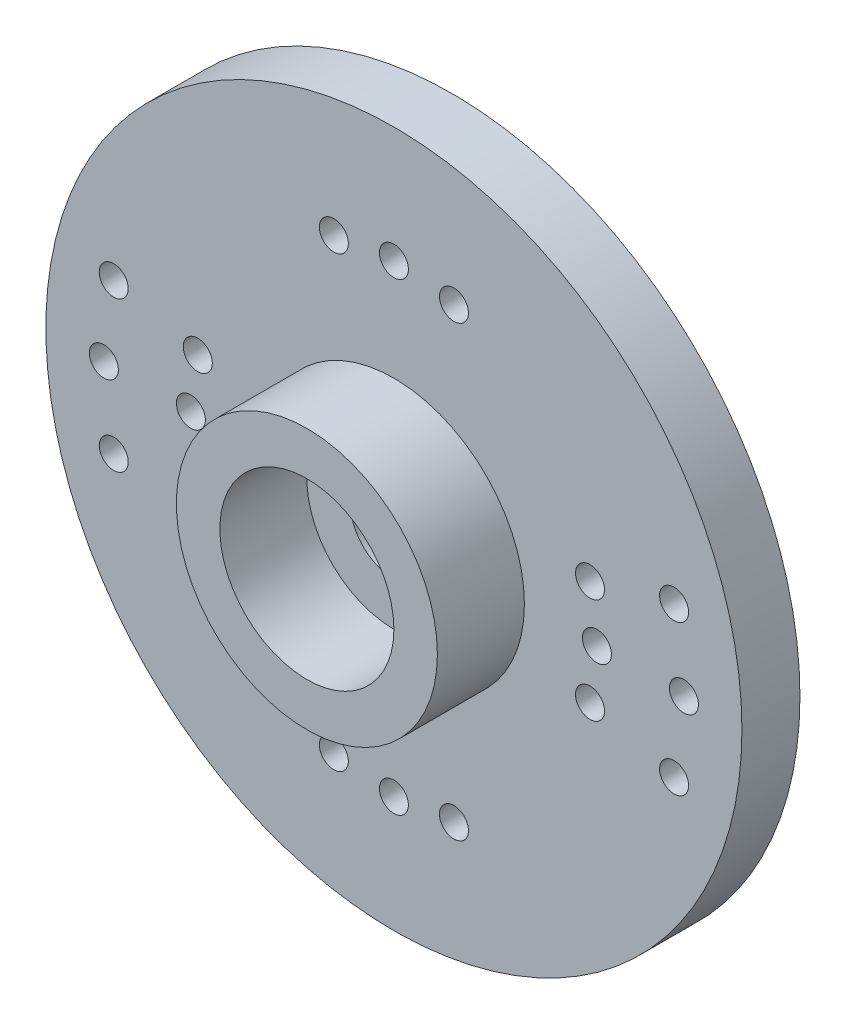
ISO-10303-21;
HEADER;
FILE_DESCRIPTION(('STEP AP214'),'2;1');
FILE_NAME('part.step','',(''),(''),'','','');
FILE_SCHEMA(('AUTOMOTIVE_DESIGN { 1 0 10303 214 1 1 1 1 }'));
ENDSEC;
DATA;
#1=APPLICATION_CONTEXT('core data for automotive mechanical design processes');
#2=APPLICATION_PROTOCOL_DEFINITION('international standard','automotive_design',2000,#1);
#3=PRODUCT_CONTEXT('',#1,'mechanical');
#4=PRODUCT('Part','Part','',(#3));
#5=PRODUCT_RELATED_PRODUCT_CATEGORY('part','',(#4));
#6=PRODUCT_DEFINITION_FORMATION('','',#4);
#7=PRODUCT_DEFINITION_CONTEXT('part definition',#1,'design');
#8=PRODUCT_DEFINITION('design','',#6,#7);
#9=PRODUCT_DEFINITION_SHAPE('','',#8);
#10=(LENGTH_UNIT() NAMED_UNIT(*) SI_UNIT(.MILLI.,.METRE.));
#11=(NAMED_UNIT(*) PLANE_ANGLE_UNIT() SI_UNIT($,.RADIAN.));
#12=(NAMED_UNIT(*) SI_UNIT($,.STERADIAN.) SOLID_ANGLE_UNIT());
#13=UNCERTAINTY_MEASURE_WITH_UNIT(LENGTH_MEASURE(1.E-05),#10,'distance_accuracy_value','');
#14=(GEOMETRIC_REPRESENTATION_CONTEXT(3) GLOBAL_UNCERTAINTY_ASSIGNED_CONTEXT((#13)) GLOBAL_UNIT_ASSIGNED_CONTEXT((#10,
#11,#12)) REPRESENTATION_CONTEXT('',''));
#15=CARTESIAN_POINT('',(0.,0.,0.));
#16=DIRECTION('',(0.,0.,1.));
#17=DIRECTION('',(1.,0.,0.));
#18=AXIS2_PLACEMENT_3D('',#15,#16,#17);
#19=CARTESIAN_POINT('',(-46.6929418583913,3.175,0.));
#20=DIRECTION('',(0.,0.,1.));
#21=DIRECTION('',(1.,0.,0.));
#22=AXIS2_PLACEMENT_3D('',#19,#20,#21);
#23=PLANE('',#22);
#24=CARTESIAN_POINT('',(-46.6929418583913,3.175,0.));
#25=DIRECTION('',(0.,0.,1.));
#26=DIRECTION('',(1.,0.,0.));
#27=AXIS2_PLACEMENT_3D('',#24,#25,#26);
#28=CIRCLE('',#27,1.5);
#29=CARTESIAN_POINT('',(-45.1929418583913,3.175,0.));
#30=VERTEX_POINT('',#29);
#31=EDGE_CURVE('E59',#30,#30,#28,.T.);
#32=ORIENTED_EDGE('',*,*,#31,.T.);
#33=EDGE_LOOP('',(#32));
#34=FACE_BOUND('',#33,.T.);
#35=CARTESIAN_POINT('',(-46.6929418583913,3.175,0.));
#36=DIRECTION('',(0.,0.,-1.));
#37=DIRECTION('',(-1.,0.,0.));
#38=AXIS2_PLACEMENT_3D('',#35,#36,#37);
#39=CIRCLE('',#38,3.);
#40=CARTESIAN_POINT('',(-49.6929418583913,3.175,0.));
#41=VERTEX_POINT('',#40);
#42=EDGE_CURVE('E69',#41,#41,#39,.T.);
#43=ORIENTED_EDGE('',*,*,#42,.T.);
#44=EDGE_LOOP('',(#43));
#45=FACE_BOUND('',#44,.T.);
#46=ADVANCED_FACE('F30',(#34,#45),#23,.F.);
#47=CARTESIAN_POINT('',(-46.6929418583913,3.175,2.));
#48=DIRECTION('',(0.,0.,-1.));
#49=DIRECTION('',(-1.,0.,0.));
#50=AXIS2_PLACEMENT_3D('',#47,#48,#49);
#51=CYLINDRICAL_SURFACE('',#50,12.);
#52=CARTESIAN_POINT('',(-46.6929418583913,3.175,2.));
#53=DIRECTION('',(0.,0.,1.));
#54=DIRECTION('',(1.,0.,0.));
#55=AXIS2_PLACEMENT_3D('',#52,#53,#54);
#56=CIRCLE('',#55,12.);
#57=CARTESIAN_POINT('',(-34.6929418583913,3.175,2.));
#58=VERTEX_POINT('',#57);
#59=EDGE_CURVE('E41',#58,#58,#56,.T.);
#60=ORIENTED_EDGE('',*,*,#59,.F.);
#61=EDGE_LOOP('',(#60));
#62=FACE_BOUND('',#61,.T.);
#63=CARTESIAN_POINT('',(-46.6929418583913,3.175,0.));
#64=DIRECTION('',(0.,0.,1.));
#65=DIRECTION('',(1.,0.,0.));
#66=AXIS2_PLACEMENT_3D('',#63,#64,#65);
#67=CIRCLE('',#66,12.);
#68=CARTESIAN_POINT('',(-34.6929418583913,3.175,0.));
#69=VERTEX_POINT('',#68);
#70=EDGE_CURVE('E45',#69,#69,#67,.T.);
#71=ORIENTED_EDGE('',*,*,#70,.T.);
#72=EDGE_LOOP('',(#71));
#73=FACE_BOUND('',#72,.T.);
#74=ADVANCED_FACE('F32',(#62,#73),#51,.T.);
#75=CARTESIAN_POINT('',(-46.6929418583913,3.175,2.));
#76=DIRECTION('',(0.,0.,1.));
#77=DIRECTION('',(1.,0.,0.));
#78=AXIS2_PLACEMENT_3D('',#75,#76,#77);
#79=PLANE('',#78);
#80=CARTESIAN_POINT('',(-56.352200121282,5.76319045102514,2.));
#81=DIRECTION('',(0.,0.,-1.));
#82=DIRECTION('',(-1.,0.,0.));
#83=AXIS2_PLACEMENT_3D('',#80,#81,#82);
#84=CIRCLE('',#83,0.499999999999997);
#85=CARTESIAN_POINT('',(-56.852200121282,5.76319045102514,2.));
#86=VERTEX_POINT('',#85);
#87=EDGE_CURVE('E177',#86,#86,#84,.T.);
#88=ORIENTED_EDGE('',*,*,#87,.T.);
#89=EDGE_LOOP('',(#88));
#90=FACE_BOUND('',#89,.T.);
#91=CARTESIAN_POINT('',(-56.6929418583913,3.17499999999993,2.));
#92=DIRECTION('',(0.,0.,-1.));
#93=DIRECTION('',(-1.,0.,0.));
#94=AXIS2_PLACEMENT_3D('',#91,#92,#93);
#95=CIRCLE('',#94,0.499999999999998);
#96=CARTESIAN_POINT('',(-57.1929418583913,3.17499999999993,2.));
#97=VERTEX_POINT('',#96);
#98=EDGE_CURVE('E171',#97,#97,#95,.T.);
#99=ORIENTED_EDGE('',*,*,#98,.T.);
#100=EDGE_LOOP('',(#99));
#101=FACE_BOUND('',#100,.T.);
#102=CARTESIAN_POINT('',(-56.352200121282,0.586809548974715,2.));
#103=DIRECTION('',(0.,0.,-1.));
#104=DIRECTION('',(-1.,0.,0.));
#105=AXIS2_PLACEMENT_3D('',#102,#103,#104);
#106=CIRCLE('',#105,0.5);
#107=CARTESIAN_POINT('',(-56.852200121282,0.586809548974715,2.));
#108=VERTEX_POINT('',#107);
#109=EDGE_CURVE('E165',#108,#108,#106,.T.);
#110=ORIENTED_EDGE('',*,*,#109,.T.);
#111=EDGE_LOOP('',(#110));
#112=FACE_BOUND('',#111,.T.);
#113=CARTESIAN_POINT('',(-53.4544226424148,1.3632666842823,2.));
#114=DIRECTION('',(0.,0.,-1.));
#115=DIRECTION('',(-1.,0.,0.));
#116=AXIS2_PLACEMENT_3D('',#113,#114,#115);
#117=CIRCLE('',#116,0.499999999999999);
#118=CARTESIAN_POINT('',(-53.9544226424148,1.3632666842823,2.));
#119=VERTEX_POINT('',#118);
#120=EDGE_CURVE('E159',#119,#119,#117,.T.);
#121=ORIENTED_EDGE('',*,*,#120,.T.);
#122=EDGE_LOOP('',(#121));
#123=FACE_BOUND('',#122,.T.);
#124=CARTESIAN_POINT('',(-53.6929418583913,3.17499999999995,2.));
#125=DIRECTION('',(0.,0.,-1.));
#126=DIRECTION('',(-1.,0.,0.));
#127=AXIS2_PLACEMENT_3D('',#124,#125,#126);
#128=CIRCLE('',#127,0.499999999999998);
#129=CARTESIAN_POINT('',(-54.1929418583913,3.17499999999995,2.));
#130=VERTEX_POINT('',#129);
#131=EDGE_CURVE('E153',#130,#130,#128,.T.);
#132=ORIENTED_EDGE('',*,*,#131,.T.);
#133=EDGE_LOOP('',(#132));
#134=FACE_BOUND('',#133,.T.);
#135=CARTESIAN_POINT('',(-53.4544226424148,4.9867333157176,2.));
#136=DIRECTION('',(0.,0.,-1.));
#137=DIRECTION('',(-1.,0.,0.));
#138=AXIS2_PLACEMENT_3D('',#135,#136,#137);
#139=CIRCLE('',#138,0.500000000000003);
#140=CARTESIAN_POINT('',(-53.9544226424148,4.9867333157176,2.));
#141=VERTEX_POINT('',#140);
#142=EDGE_CURVE('E147',#141,#141,#139,.T.);
#143=ORIENTED_EDGE('',*,*,#142,.T.);
#144=EDGE_LOOP('',(#143));
#145=FACE_BOUND('',#144,.T.);
#146=CARTESIAN_POINT('',(-48.7634942192115,10.9024066103125,2.));
#147=DIRECTION('',(0.,0.,-1.));
#148=DIRECTION('',(-1.,0.,0.));
#149=AXIS2_PLACEMENT_3D('',#146,#147,#148);
#150=CIRCLE('',#149,0.499999999999992);
#151=CARTESIAN_POINT('',(-49.2634942192115,10.9024066103125,2.));
#152=VERTEX_POINT('',#151);
#153=EDGE_CURVE('E141',#152,#152,#150,.T.);
#154=ORIENTED_EDGE('',*,*,#153,.T.);
#155=EDGE_LOOP('',(#154));
#156=FACE_BOUND('',#155,.T.);
#157=CARTESIAN_POINT('',(-46.6929418583913,11.175,2.));
#158=DIRECTION('',(0.,0.,-1.));
#159=DIRECTION('',(-1.,0.,0.));
#160=AXIS2_PLACEMENT_3D('',#157,#158,#159);
#161=CIRCLE('',#160,0.499999999999999);
#162=CARTESIAN_POINT('',(-47.1929418583913,11.175,2.));
#163=VERTEX_POINT('',#162);
#164=EDGE_CURVE('E135',#163,#163,#161,.T.);
#165=ORIENTED_EDGE('',*,*,#164,.T.);
#166=EDGE_LOOP('',(#165));
#167=FACE_BOUND('',#166,.T.);
#168=CARTESIAN_POINT('',(-44.6223894975711,10.9024066103125,2.));
#169=DIRECTION('',(0.,0.,-1.));
#170=DIRECTION('',(-1.,0.,0.));
#171=AXIS2_PLACEMENT_3D('',#168,#169,#170);
#172=CIRCLE('',#171,0.499999999999999);
#173=CARTESIAN_POINT('',(-45.1223894975711,10.9024066103125,2.));
#174=VERTEX_POINT('',#173);
#175=EDGE_CURVE('E129',#174,#174,#172,.T.);
#176=ORIENTED_EDGE('',*,*,#175,.T.);
#177=EDGE_LOOP('',(#176));
#178=FACE_BOUND('',#177,.T.);
#179=CARTESIAN_POINT('',(-39.9314610743678,4.98673331571765,2.));
#180=DIRECTION('',(0.,0.,-1.));
#181=DIRECTION('',(-1.,0.,0.));
#182=AXIS2_PLACEMENT_3D('',#179,#180,#181);
#183=CIRCLE('',#182,0.5);
#184=CARTESIAN_POINT('',(-40.4314610743678,4.98673331571765,2.));
#185=VERTEX_POINT('',#184);
#186=EDGE_CURVE('E123',#185,#185,#183,.T.);
#187=ORIENTED_EDGE('',*,*,#186,.T.);
#188=EDGE_LOOP('',(#187));
#189=FACE_BOUND('',#188,.T.);
#190=CARTESIAN_POINT('',(-37.0336835955006,5.76319045102521,2.));
#191=DIRECTION('',(0.,0.,-1.));
#192=DIRECTION('',(-1.,0.,0.));
#193=AXIS2_PLACEMENT_3D('',#190,#191,#192);
#194=CIRCLE('',#193,0.5);
#195=CARTESIAN_POINT('',(-37.5336835955006,5.76319045102521,2.));
#196=VERTEX_POINT('',#195);
#197=EDGE_CURVE('E117',#196,#196,#194,.T.);
#198=ORIENTED_EDGE('',*,*,#197,.T.);
#199=EDGE_LOOP('',(#198));
#200=FACE_BOUND('',#199,.T.);
#201=CARTESIAN_POINT('',(-39.6929418583913,3.175,2.));
#202=DIRECTION('',(0.,0.,-1.));
#203=DIRECTION('',(-1.,0.,0.));
#204=AXIS2_PLACEMENT_3D('',#201,#202,#203);
#205=CIRCLE('',#204,0.499999999999999);
#206=CARTESIAN_POINT('',(-40.1929418583913,3.175,2.));
#207=VERTEX_POINT('',#206);
#208=EDGE_CURVE('E111',#207,#207,#205,.T.);
#209=ORIENTED_EDGE('',*,*,#208,.T.);
#210=EDGE_LOOP('',(#209));
#211=FACE_BOUND('',#210,.T.);
#212=CARTESIAN_POINT('',(-36.6929418583913,3.175,2.));
#213=DIRECTION('',(0.,0.,-1.));
#214=DIRECTION('',(-1.,0.,0.));
#215=AXIS2_PLACEMENT_3D('',#212,#213,#214);
#216=CIRCLE('',#215,0.499999999999999);
#217=CARTESIAN_POINT('',(-37.1929418583913,3.175,2.));
#218=VERTEX_POINT('',#217);
#219=EDGE_CURVE('E105',#218,#218,#216,.T.);
#220=ORIENTED_EDGE('',*,*,#219,.T.);
#221=EDGE_LOOP('',(#220));
#222=FACE_BOUND('',#221,.T.);
#223=CARTESIAN_POINT('',(-37.0336835955006,0.586809548974783,2.));
#224=DIRECTION('',(0.,0.,-1.));
#225=DIRECTION('',(-1.,0.,0.));
#226=AXIS2_PLACEMENT_3D('',#223,#224,#225);
#227=CIRCLE('',#226,0.499999999999997);
#228=CARTESIAN_POINT('',(-37.5336835955006,0.586809548974783,2.));
#229=VERTEX_POINT('',#228);
#230=EDGE_CURVE('E99',#229,#229,#227,.T.);
#231=ORIENTED_EDGE('',*,*,#230,.T.);
#232=EDGE_LOOP('',(#231));
#233=FACE_BOUND('',#232,.T.);
#234=CARTESIAN_POINT('',(-39.9314610743678,1.36326668428235,2.));
#235=DIRECTION('',(0.,0.,-1.));
#236=DIRECTION('',(-1.,0.,0.));
#237=AXIS2_PLACEMENT_3D('',#234,#235,#236);
#238=CIRCLE('',#237,0.499999999999998);
#239=CARTESIAN_POINT('',(-40.4314610743678,1.36326668428235,2.));
#240=VERTEX_POINT('',#239);
#241=EDGE_CURVE('E93',#240,#240,#238,.T.);
#242=ORIENTED_EDGE('',*,*,#241,.T.);
#243=EDGE_LOOP('',(#242));
#244=FACE_BOUND('',#243,.T.);
#245=CARTESIAN_POINT('',(-46.6929418583913,-4.825,2.));
#246=DIRECTION('',(0.,0.,-1.));
#247=DIRECTION('',(-1.,0.,0.));
#248=AXIS2_PLACEMENT_3D('',#245,#246,#247);
#249=CIRCLE('',#248,0.499999999999999);
#250=CARTESIAN_POINT('',(-47.1929418583913,-4.825,2.));
#251=VERTEX_POINT('',#250);
#252=EDGE_CURVE('E87',#251,#251,#249,.T.);
#253=ORIENTED_EDGE('',*,*,#252,.T.);
#254=EDGE_LOOP('',(#253));
#255=FACE_BOUND('',#254,.T.);
#256=CARTESIAN_POINT('',(-44.6223894975711,-4.55240661031254,2.));
#257=DIRECTION('',(0.,0.,-1.));
#258=DIRECTION('',(-1.,0.,0.));
#259=AXIS2_PLACEMENT_3D('',#256,#257,#258);
#260=CIRCLE('',#259,0.499999999999999);
#261=CARTESIAN_POINT('',(-45.1223894975711,-4.55240661031254,2.));
#262=VERTEX_POINT('',#261);
#263=EDGE_CURVE('E81',#262,#262,#260,.T.);
#264=ORIENTED_EDGE('',*,*,#263,.T.);
#265=EDGE_LOOP('',(#264));
#266=FACE_BOUND('',#265,.T.);
#267=CARTESIAN_POINT('',(-48.7634942192115,-4.55240661031255,2.));
#268=DIRECTION('',(0.,0.,-1.));
#269=DIRECTION('',(-1.,0.,0.));
#270=AXIS2_PLACEMENT_3D('',#267,#268,#269);
#271=CIRCLE('',#270,0.499999999999999);
#272=CARTESIAN_POINT('',(-49.2634942192115,-4.55240661031255,2.));
#273=VERTEX_POINT('',#272);
#274=EDGE_CURVE('E72',#273,#273,#271,.T.);
#275=ORIENTED_EDGE('',*,*,#274,.T.);
#276=EDGE_LOOP('',(#275));
#277=FACE_BOUND('',#276,.T.);
#278=CARTESIAN_POINT('',(-46.6929418583913,3.175,2.));
#279=DIRECTION('',(0.,0.,1.));
#280=DIRECTION('',(1.,0.,0.));
#281=AXIS2_PLACEMENT_3D('',#278,#279,#280);
#282=CIRCLE('',#281,4.5);
#283=CARTESIAN_POINT('',(-42.1929418583913,3.175,2.));
#284=VERTEX_POINT('',#283);
#285=EDGE_CURVE('E51',#284,#284,#282,.T.);
#286=ORIENTED_EDGE('',*,*,#285,.F.);
#287=EDGE_LOOP('',(#286));
#288=FACE_BOUND('',#287,.T.);
#289=ORIENTED_EDGE('',*,*,#59,.T.);
#290=EDGE_LOOP('',(#289));
#291=FACE_BOUND('',#290,.T.);
#292=ADVANCED_FACE('F189',(#90,#101,#112,#123,#134,#145,#156,#167,#178,#189,#200,#211,#222,#233,
#244,#255,#266,#277,#288,#291),#79,.T.);
#293=CARTESIAN_POINT('',(-56.352200121282,5.76319045102514,0.));
#294=DIRECTION('',(0.,0.,-1.));
#295=DIRECTION('',(-1.,0.,0.));
#296=AXIS2_PLACEMENT_3D('',#293,#294,#295);
#297=CIRCLE('',#296,0.499999999999997);
#298=CARTESIAN_POINT('',(-56.852200121282,5.76319045102514,0.));
#299=VERTEX_POINT('',#298);
#300=EDGE_CURVE('E174',#299,#299,#297,.T.);
#301=ORIENTED_EDGE('',*,*,#300,.F.);
#302=EDGE_LOOP('',(#301));
#303=FACE_BOUND('',#302,.T.);
#304=CARTESIAN_POINT('',(-56.6929418583913,3.17499999999993,0.));
#305=DIRECTION('',(0.,0.,-1.));
#306=DIRECTION('',(-1.,0.,0.));
#307=AXIS2_PLACEMENT_3D('',#304,#305,#306);
#308=CIRCLE('',#307,0.499999999999998);
#309=CARTESIAN_POINT('',(-57.1929418583913,3.17499999999993,0.));
#310=VERTEX_POINT('',#309);
#311=EDGE_CURVE('E168',#310,#310,#308,.T.);
#312=ORIENTED_EDGE('',*,*,#311,.F.);
#313=EDGE_LOOP('',(#312));
#314=FACE_BOUND('',#313,.T.);
#315=CARTESIAN_POINT('',(-56.352200121282,0.586809548974715,0.));
#316=DIRECTION('',(0.,0.,-1.));
#317=DIRECTION('',(-1.,0.,0.));
#318=AXIS2_PLACEMENT_3D('',#315,#316,#317);
#319=CIRCLE('',#318,0.5);
#320=CARTESIAN_POINT('',(-56.852200121282,0.586809548974715,0.));
#321=VERTEX_POINT('',#320);
#322=EDGE_CURVE('E162',#321,#321,#319,.T.);
#323=ORIENTED_EDGE('',*,*,#322,.F.);
#324=EDGE_LOOP('',(#323));
#325=FACE_BOUND('',#324,.T.);
#326=CARTESIAN_POINT('',(-53.4544226424148,1.3632666842823,0.));
#327=DIRECTION('',(0.,0.,-1.));
#328=DIRECTION('',(-1.,0.,0.));
#329=AXIS2_PLACEMENT_3D('',#326,#327,#328);
#330=CIRCLE('',#329,0.499999999999999);
#331=CARTESIAN_POINT('',(-53.9544226424148,1.3632666842823,0.));
#332=VERTEX_POINT('',#331);
#333=EDGE_CURVE('E156',#332,#332,#330,.T.);
#334=ORIENTED_EDGE('',*,*,#333,.F.);
#335=EDGE_LOOP('',(#334));
#336=FACE_BOUND('',#335,.T.);
#337=CARTESIAN_POINT('',(-53.6929418583913,3.17499999999995,0.));
#338=DIRECTION('',(0.,0.,-1.));
#339=DIRECTION('',(-1.,0.,0.));
#340=AXIS2_PLACEMENT_3D('',#337,#338,#339);
#341=CIRCLE('',#340,0.499999999999998);
#342=CARTESIAN_POINT('',(-54.1929418583913,3.17499999999995,0.));
#343=VERTEX_POINT('',#342);
#344=EDGE_CURVE('E150',#343,#343,#341,.T.);
#345=ORIENTED_EDGE('',*,*,#344,.F.);
#346=EDGE_LOOP('',(#345));
#347=FACE_BOUND('',#346,.T.);
#348=CARTESIAN_POINT('',(-53.4544226424148,4.9867333157176,0.));
#349=DIRECTION('',(0.,0.,-1.));
#350=DIRECTION('',(-1.,0.,0.));
#351=AXIS2_PLACEMENT_3D('',#348,#349,#350);
#352=CIRCLE('',#351,0.500000000000003);
#353=CARTESIAN_POINT('',(-53.9544226424148,4.9867333157176,0.));
#354=VERTEX_POINT('',#353);
#355=EDGE_CURVE('E144',#354,#354,#352,.T.);
#356=ORIENTED_EDGE('',*,*,#355,.F.);
#357=EDGE_LOOP('',(#356));
#358=FACE_BOUND('',#357,.T.);
#359=CARTESIAN_POINT('',(-48.7634942192115,10.9024066103125,0.));
#360=DIRECTION('',(0.,0.,-1.));
#361=DIRECTION('',(-1.,0.,0.));
#362=AXIS2_PLACEMENT_3D('',#359,#360,#361);
#363=CIRCLE('',#362,0.499999999999992);
#364=CARTESIAN_POINT('',(-49.2634942192115,10.9024066103125,0.));
#365=VERTEX_POINT('',#364);
#366=EDGE_CURVE('E138',#365,#365,#363,.T.);
#367=ORIENTED_EDGE('',*,*,#366,.F.);
#368=EDGE_LOOP('',(#367));
#369=FACE_BOUND('',#368,.T.);
#370=CARTESIAN_POINT('',(-46.6929418583913,11.175,0.));
#371=DIRECTION('',(0.,0.,-1.));
#372=DIRECTION('',(-1.,0.,0.));
#373=AXIS2_PLACEMENT_3D('',#370,#371,#372);
#374=CIRCLE('',#373,0.499999999999999);
#375=CARTESIAN_POINT('',(-47.1929418583913,11.175,0.));
#376=VERTEX_POINT('',#375);
#377=EDGE_CURVE('E132',#376,#376,#374,.T.);
#378=ORIENTED_EDGE('',*,*,#377,.F.);
#379=EDGE_LOOP('',(#378));
#380=FACE_BOUND('',#379,.T.);
#381=CARTESIAN_POINT('',(-44.6223894975711,10.9024066103125,0.));
#382=DIRECTION('',(0.,0.,-1.));
#383=DIRECTION('',(-1.,0.,0.));
#384=AXIS2_PLACEMENT_3D('',#381,#382,#383);
#385=CIRCLE('',#384,0.499999999999999);
#386=CARTESIAN_POINT('',(-45.1223894975711,10.9024066103125,0.));
#387=VERTEX_POINT('',#386);
#388=EDGE_CURVE('E126',#387,#387,#385,.T.);
#389=ORIENTED_EDGE('',*,*,#388,.F.);
#390=EDGE_LOOP('',(#389));
#391=FACE_BOUND('',#390,.T.);
#392=CARTESIAN_POINT('',(-39.9314610743678,4.98673331571765,0.));
#393=DIRECTION('',(0.,0.,-1.));
#394=DIRECTION('',(-1.,0.,0.));
#395=AXIS2_PLACEMENT_3D('',#392,#393,#394);
#396=CIRCLE('',#395,0.5);
#397=CARTESIAN_POINT('',(-40.4314610743678,4.98673331571765,0.));
#398=VERTEX_POINT('',#397);
#399=EDGE_CURVE('E120',#398,#398,#396,.T.);
#400=ORIENTED_EDGE('',*,*,#399,.F.);
#401=EDGE_LOOP('',(#400));
#402=FACE_BOUND('',#401,.T.);
#403=CARTESIAN_POINT('',(-37.0336835955006,5.76319045102521,0.));
#404=DIRECTION('',(0.,0.,-1.));
#405=DIRECTION('',(-1.,0.,0.));
#406=AXIS2_PLACEMENT_3D('',#403,#404,#405);
#407=CIRCLE('',#406,0.5);
#408=CARTESIAN_POINT('',(-37.5336835955006,5.76319045102521,0.));
#409=VERTEX_POINT('',#408);
#410=EDGE_CURVE('E114',#409,#409,#407,.T.);
#411=ORIENTED_EDGE('',*,*,#410,.F.);
#412=EDGE_LOOP('',(#411));
#413=FACE_BOUND('',#412,.T.);
#414=CARTESIAN_POINT('',(-39.6929418583913,3.175,0.));
#415=DIRECTION('',(0.,0.,-1.));
#416=DIRECTION('',(-1.,0.,0.));
#417=AXIS2_PLACEMENT_3D('',#414,#415,#416);
#418=CIRCLE('',#417,0.499999999999999);
#419=CARTESIAN_POINT('',(-40.1929418583913,3.175,0.));
#420=VERTEX_POINT('',#419);
#421=EDGE_CURVE('E108',#420,#420,#418,.T.);
#422=ORIENTED_EDGE('',*,*,#421,.F.);
#423=EDGE_LOOP('',(#422));
#424=FACE_BOUND('',#423,.T.);
#425=CARTESIAN_POINT('',(-36.6929418583913,3.175,0.));
#426=DIRECTION('',(0.,0.,-1.));
#427=DIRECTION('',(-1.,0.,0.));
#428=AXIS2_PLACEMENT_3D('',#425,#426,#427);
#429=CIRCLE('',#428,0.499999999999999);
#430=CARTESIAN_POINT('',(-37.1929418583913,3.175,0.));
#431=VERTEX_POINT('',#430);
#432=EDGE_CURVE('E102',#431,#431,#429,.T.);
#433=ORIENTED_EDGE('',*,*,#432,.F.);
#434=EDGE_LOOP('',(#433));
#435=FACE_BOUND('',#434,.T.);
#436=CARTESIAN_POINT('',(-37.0336835955006,0.586809548974783,0.));
#437=DIRECTION('',(0.,0.,-1.));
#438=DIRECTION('',(-1.,0.,0.));
#439=AXIS2_PLACEMENT_3D('',#436,#437,#438);
#440=CIRCLE('',#439,0.499999999999997);
#441=CARTESIAN_POINT('',(-37.5336835955006,0.586809548974783,0.));
#442=VERTEX_POINT('',#441);
#443=EDGE_CURVE('E96',#442,#442,#440,.T.);
#444=ORIENTED_EDGE('',*,*,#443,.F.);
#445=EDGE_LOOP('',(#444));
#446=FACE_BOUND('',#445,.T.);
#447=CARTESIAN_POINT('',(-39.9314610743678,1.36326668428235,0.));
#448=DIRECTION('',(0.,0.,-1.));
#449=DIRECTION('',(-1.,0.,0.));
#450=AXIS2_PLACEMENT_3D('',#447,#448,#449);
#451=CIRCLE('',#450,0.499999999999998);
#452=CARTESIAN_POINT('',(-40.4314610743678,1.36326668428235,0.));
#453=VERTEX_POINT('',#452);
#454=EDGE_CURVE('E90',#453,#453,#451,.T.);
#455=ORIENTED_EDGE('',*,*,#454,.F.);
#456=EDGE_LOOP('',(#455));
#457=FACE_BOUND('',#456,.T.);
#458=CARTESIAN_POINT('',(-46.6929418583913,-4.825,0.));
#459=DIRECTION('',(0.,0.,-1.));
#460=DIRECTION('',(-1.,0.,0.));
#461=AXIS2_PLACEMENT_3D('',#458,#459,#460);
#462=CIRCLE('',#461,0.499999999999999);
#463=CARTESIAN_POINT('',(-47.1929418583913,-4.825,0.));
#464=VERTEX_POINT('',#463);
#465=EDGE_CURVE('E84',#464,#464,#462,.T.);
#466=ORIENTED_EDGE('',*,*,#465,.F.);
#467=EDGE_LOOP('',(#466));
#468=FACE_BOUND('',#467,.T.);
#469=CARTESIAN_POINT('',(-44.6223894975711,-4.55240661031254,0.));
#470=DIRECTION('',(0.,0.,-1.));
#471=DIRECTION('',(-1.,0.,0.));
#472=AXIS2_PLACEMENT_3D('',#469,#470,#471);
#473=CIRCLE('',#472,0.499999999999999);
#474=CARTESIAN_POINT('',(-45.1223894975711,-4.55240661031254,0.));
#475=VERTEX_POINT('',#474);
#476=EDGE_CURVE('E78',#475,#475,#473,.T.);
#477=ORIENTED_EDGE('',*,*,#476,.F.);
#478=EDGE_LOOP('',(#477));
#479=FACE_BOUND('',#478,.T.);
#480=CARTESIAN_POINT('',(-48.7634942192115,-4.55240661031255,0.));
#481=DIRECTION('',(0.,0.,-1.));
#482=DIRECTION('',(-1.,0.,0.));
#483=AXIS2_PLACEMENT_3D('',#480,#481,#482);
#484=CIRCLE('',#483,0.499999999999999);
#485=CARTESIAN_POINT('',(-49.2634942192115,-4.55240661031255,0.));
#486=VERTEX_POINT('',#485);
#487=EDGE_CURVE('E75',#486,#486,#484,.T.);
#488=ORIENTED_EDGE('',*,*,#487,.F.);
#489=EDGE_LOOP('',(#488));
#490=FACE_BOUND('',#489,.T.);
#491=CARTESIAN_POINT('',(-46.6929418583913,3.175,0.));
#492=DIRECTION('',(0.,0.,1.));
#493=DIRECTION('',(1.,0.,0.));
#494=AXIS2_PLACEMENT_3D('',#491,#492,#493);
#495=CIRCLE('',#494,4.);
#496=CARTESIAN_POINT('',(-42.6929418583913,3.175,0.));
#497=VERTEX_POINT('',#496);
#498=EDGE_CURVE('E10',#497,#497,#495,.F.);
#499=ORIENTED_EDGE('',*,*,#498,.F.);
#500=EDGE_LOOP('',(#499));
#501=FACE_BOUND('',#500,.T.);
#502=ORIENTED_EDGE('',*,*,#70,.F.);
#503=EDGE_LOOP('',(#502));
#504=FACE_BOUND('',#503,.T.);
#505=ADVANCED_FACE('F185',(#303,#314,#325,#336,#347,#358,#369,#380,#391,#402,#413,#424,#435,
#446,#457,#468,#479,#490,#501,#504),#23,.F.);
#506=CARTESIAN_POINT('',(-46.6929418583913,3.175,5.));
#507=DIRECTION('',(0.,0.,1.));
#508=DIRECTION('',(1.,0.,0.));
#509=AXIS2_PLACEMENT_3D('',#506,#507,#508);
#510=PLANE('',#509);
#511=CARTESIAN_POINT('',(-46.6929418583913,3.175,5.));
#512=DIRECTION('',(0.,0.,1.));
#513=DIRECTION('',(1.,0.,0.));
#514=AXIS2_PLACEMENT_3D('',#511,#512,#513);
#515=CIRCLE('',#514,4.5);
#516=CARTESIAN_POINT('',(-42.1929418583913,3.175,5.));
#517=VERTEX_POINT('',#516);
#518=EDGE_CURVE('E49',#517,#517,#515,.T.);
#519=ORIENTED_EDGE('',*,*,#518,.T.);
#520=EDGE_LOOP('',(#519));
#521=FACE_BOUND('',#520,.T.);
#522=CARTESIAN_POINT('',(-46.6929418583913,3.175,5.));
#523=DIRECTION('',(0.,0.,1.));
#524=DIRECTION('',(1.,0.,0.));
#525=AXIS2_PLACEMENT_3D('',#522,#523,#524);
#526=CIRCLE('',#525,3.);
#527=CARTESIAN_POINT('',(-43.6929418583913,3.175,5.));
#528=VERTEX_POINT('',#527);
#529=EDGE_CURVE('E54',#528,#528,#526,.T.);
#530=ORIENTED_EDGE('',*,*,#529,.F.);
#531=EDGE_LOOP('',(#530));
#532=FACE_BOUND('',#531,.T.);
#533=ADVANCED_FACE('F188',(#521,#532),#510,.T.);
#534=CARTESIAN_POINT('',(-46.6929418583913,3.175,5.));
#535=DIRECTION('',(0.,0.,-1.));
#536=DIRECTION('',(-1.,0.,0.));
#537=AXIS2_PLACEMENT_3D('',#534,#535,#536);
#538=CYLINDRICAL_SURFACE('',#537,4.5);
#539=ORIENTED_EDGE('',*,*,#518,.F.);
#540=EDGE_LOOP('',(#539));
#541=FACE_BOUND('',#540,.T.);
#542=ORIENTED_EDGE('',*,*,#285,.T.);
#543=EDGE_LOOP('',(#542));
#544=FACE_BOUND('',#543,.T.);
#545=ADVANCED_FACE('F243',(#541,#544),#538,.T.);
#546=CARTESIAN_POINT('',(-46.6929418583913,3.175,5.));
#547=DIRECTION('',(0.,0.,-1.));
#548=DIRECTION('',(-1.,0.,0.));
#549=AXIS2_PLACEMENT_3D('',#546,#547,#548);
#550=CYLINDRICAL_SURFACE('',#549,3.);
#551=ORIENTED_EDGE('',*,*,#529,.T.);
#552=EDGE_LOOP('',(#551));
#553=FACE_BOUND('',#552,.T.);
#554=CARTESIAN_POINT('',(-46.6929418583913,3.175,2.));
#555=DIRECTION('',(0.,0.,1.));
#556=DIRECTION('',(1.,0.,0.));
#557=AXIS2_PLACEMENT_3D('',#554,#555,#556);
#558=CIRCLE('',#557,3.);
#559=CARTESIAN_POINT('',(-43.6929418583913,3.175,2.));
#560=VERTEX_POINT('',#559);
#561=EDGE_CURVE('E37',#560,#560,#558,.F.);
#562=ORIENTED_EDGE('',*,*,#561,.T.);
#563=EDGE_LOOP('',(#562));
#564=FACE_BOUND('',#563,.T.);
#565=ADVANCED_FACE('F246',(#553,#564),#550,.F.);
#566=CARTESIAN_POINT('',(-46.6929418583913,3.175,2.));
#567=DIRECTION('',(0.,0.,1.));
#568=DIRECTION('',(1.,0.,0.));
#569=AXIS2_PLACEMENT_3D('',#566,#567,#568);
#570=CIRCLE('',#569,1.5);
#571=CARTESIAN_POINT('',(-45.1929418583913,3.175,2.));
#572=VERTEX_POINT('',#571);
#573=EDGE_CURVE('E62',#572,#572,#570,.T.);
#574=ORIENTED_EDGE('',*,*,#573,.F.);
#575=EDGE_LOOP('',(#574));
#576=FACE_BOUND('',#575,.T.);
#577=ORIENTED_EDGE('',*,*,#561,.F.);
#578=EDGE_LOOP('',(#577));
#579=FACE_BOUND('',#578,.T.);
#580=ADVANCED_FACE('F235',(#576,#579),#79,.T.);
#581=CARTESIAN_POINT('',(-46.6929418583913,3.175,-1.));
#582=DIRECTION('',(0.,0.,1.));
#583=DIRECTION('',(1.,0.,0.));
#584=AXIS2_PLACEMENT_3D('',#581,#582,#583);
#585=CYLINDRICAL_SURFACE('',#584,1.5);
#586=ORIENTED_EDGE('',*,*,#573,.T.);
#587=EDGE_LOOP('',(#586));
#588=FACE_BOUND('',#587,.T.);
#589=ORIENTED_EDGE('',*,*,#31,.F.);
#590=EDGE_LOOP('',(#589));
#591=FACE_BOUND('',#590,.T.);
#592=ADVANCED_FACE('F254',(#588,#591),#585,.F.);
#593=CARTESIAN_POINT('',(-46.6929418583913,3.175,-1.));
#594=DIRECTION('',(0.,0.,-1.));
#595=DIRECTION('',(-1.,0.,0.));
#596=AXIS2_PLACEMENT_3D('',#593,#594,#595);
#597=PLANE('',#596);
#598=CARTESIAN_POINT('',(-46.6929418583913,3.175,-1.));
#599=DIRECTION('',(0.,0.,-1.));
#600=DIRECTION('',(-1.,0.,0.));
#601=AXIS2_PLACEMENT_3D('',#598,#599,#600);
#602=CIRCLE('',#601,4.);
#603=CARTESIAN_POINT('',(-50.6929418583913,3.175,-1.));
#604=VERTEX_POINT('',#603);
#605=EDGE_CURVE('E65',#604,#604,#602,.T.);
#606=ORIENTED_EDGE('',*,*,#605,.T.);
#607=EDGE_LOOP('',(#606));
#608=FACE_BOUND('',#607,.T.);
#609=CARTESIAN_POINT('',(-46.6929418583913,3.175,-1.));
#610=DIRECTION('',(0.,0.,-1.));
#611=DIRECTION('',(-1.,0.,0.));
#612=AXIS2_PLACEMENT_3D('',#609,#610,#611);
#613=CIRCLE('',#612,3.);
#614=CARTESIAN_POINT('',(-49.6929418583913,3.175,-1.));
#615=VERTEX_POINT('',#614);
#616=EDGE_CURVE('E68',#615,#615,#613,.T.);
#617=ORIENTED_EDGE('',*,*,#616,.F.);
#618=EDGE_LOOP('',(#617));
#619=FACE_BOUND('',#618,.T.);
#620=ADVANCED_FACE('F257',(#608,#619),#597,.T.);
#621=CARTESIAN_POINT('',(-46.6929418583913,3.175,-1.));
#622=DIRECTION('',(0.,0.,1.));
#623=DIRECTION('',(1.,0.,0.));
#624=AXIS2_PLACEMENT_3D('',#621,#622,#623);
#625=CYLINDRICAL_SURFACE('',#624,4.);
#626=ORIENTED_EDGE('',*,*,#605,.F.);
#627=EDGE_LOOP('',(#626));
#628=FACE_BOUND('',#627,.T.);
#629=ORIENTED_EDGE('',*,*,#498,.T.);
#630=EDGE_LOOP('',(#629));
#631=FACE_BOUND('',#630,.T.);
#632=ADVANCED_FACE('F259',(#628,#631),#625,.T.);
#633=CARTESIAN_POINT('',(-46.6929418583913,3.175,-1.));
#634=DIRECTION('',(0.,0.,1.));
#635=DIRECTION('',(1.,0.,0.));
#636=AXIS2_PLACEMENT_3D('',#633,#634,#635);
#637=CYLINDRICAL_SURFACE('',#636,3.);
#638=ORIENTED_EDGE('',*,*,#616,.T.);
#639=EDGE_LOOP('',(#638));
#640=FACE_BOUND('',#639,.T.);
#641=ORIENTED_EDGE('',*,*,#42,.F.);
#642=EDGE_LOOP('',(#641));
#643=FACE_BOUND('',#642,.T.);
#644=ADVANCED_FACE('F262',(#640,#643),#637,.F.);
#645=CARTESIAN_POINT('',(-48.7634942192115,-4.55240661031255,2.));
#646=DIRECTION('',(0.,0.,-1.));
#647=DIRECTION('',(-1.,0.,0.));
#648=AXIS2_PLACEMENT_3D('',#645,#646,#647);
#649=CYLINDRICAL_SURFACE('',#648,0.499999999999999);
#650=ORIENTED_EDGE('',*,*,#274,.F.);
#651=EDGE_LOOP('',(#650));
#652=FACE_BOUND('',#651,.T.);
#653=ORIENTED_EDGE('',*,*,#487,.T.);
#654=EDGE_LOOP('',(#653));
#655=FACE_BOUND('',#654,.T.);
#656=ADVANCED_FACE('F269',(#652,#655),#649,.F.);
#657=CARTESIAN_POINT('',(-44.6223894975711,-4.55240661031254,2.));
#658=DIRECTION('',(0.,0.,-1.));
#659=DIRECTION('',(-1.,0.,0.));
#660=AXIS2_PLACEMENT_3D('',#657,#658,#659);
#661=CYLINDRICAL_SURFACE('',#660,0.499999999999999);
#662=ORIENTED_EDGE('',*,*,#263,.F.);
#663=EDGE_LOOP('',(#662));
#664=FACE_BOUND('',#663,.T.);
#665=ORIENTED_EDGE('',*,*,#476,.T.);
#666=EDGE_LOOP('',(#665));
#667=FACE_BOUND('',#666,.T.);
#668=ADVANCED_FACE('F273',(#664,#667),#661,.F.);
#669=CARTESIAN_POINT('',(-46.6929418583913,-4.825,2.));
#670=DIRECTION('',(0.,0.,-1.));
#671=DIRECTION('',(-1.,0.,0.));
#672=AXIS2_PLACEMENT_3D('',#669,#670,#671);
#673=CYLINDRICAL_SURFACE('',#672,0.499999999999999);
#674=ORIENTED_EDGE('',*,*,#252,.F.);
#675=EDGE_LOOP('',(#674));
#676=FACE_BOUND('',#675,.T.);
#677=ORIENTED_EDGE('',*,*,#465,.T.);
#678=EDGE_LOOP('',(#677));
#679=FACE_BOUND('',#678,.T.);
#680=ADVANCED_FACE('F277',(#676,#679),#673,.F.);
#681=CARTESIAN_POINT('',(-39.9314610743678,1.36326668428235,2.));
#682=DIRECTION('',(0.,0.,-1.));
#683=DIRECTION('',(-1.,0.,0.));
#684=AXIS2_PLACEMENT_3D('',#681,#682,#683);
#685=CYLINDRICAL_SURFACE('',#684,0.499999999999998);
#686=ORIENTED_EDGE('',*,*,#241,.F.);
#687=EDGE_LOOP('',(#686));
#688=FACE_BOUND('',#687,.T.);
#689=ORIENTED_EDGE('',*,*,#454,.T.);
#690=EDGE_LOOP('',(#689));
#691=FACE_BOUND('',#690,.T.);
#692=ADVANCED_FACE('F281',(#688,#691),#685,.F.);
#693=CARTESIAN_POINT('',(-37.0336835955006,0.586809548974783,2.));
#694=DIRECTION('',(0.,0.,-1.));
#695=DIRECTION('',(-1.,0.,0.));
#696=AXIS2_PLACEMENT_3D('',#693,#694,#695);
#697=CYLINDRICAL_SURFACE('',#696,0.499999999999997);
#698=ORIENTED_EDGE('',*,*,#230,.F.);
#699=EDGE_LOOP('',(#698));
#700=FACE_BOUND('',#699,.T.);
#701=ORIENTED_EDGE('',*,*,#443,.T.);
#702=EDGE_LOOP('',(#701));
#703=FACE_BOUND('',#702,.T.);
#704=ADVANCED_FACE('F285',(#700,#703),#697,.F.);
#705=CARTESIAN_POINT('',(-36.6929418583913,3.175,2.));
#706=DIRECTION('',(0.,0.,-1.));
#707=DIRECTION('',(-1.,0.,0.));
#708=AXIS2_PLACEMENT_3D('',#705,#706,#707);
#709=CYLINDRICAL_SURFACE('',#708,0.499999999999999);
#710=ORIENTED_EDGE('',*,*,#219,.F.);
#711=EDGE_LOOP('',(#710));
#712=FACE_BOUND('',#711,.T.);
#713=ORIENTED_EDGE('',*,*,#432,.T.);
#714=EDGE_LOOP('',(#713));
#715=FACE_BOUND('',#714,.T.);
#716=ADVANCED_FACE('F289',(#712,#715),#709,.F.);
#717=CARTESIAN_POINT('',(-39.6929418583913,3.175,2.));
#718=DIRECTION('',(0.,0.,-1.));
#719=DIRECTION('',(-1.,0.,0.));
#720=AXIS2_PLACEMENT_3D('',#717,#718,#719);
#721=CYLINDRICAL_SURFACE('',#720,0.499999999999999);
#722=ORIENTED_EDGE('',*,*,#208,.F.);
#723=EDGE_LOOP('',(#722));
#724=FACE_BOUND('',#723,.T.);
#725=ORIENTED_EDGE('',*,*,#421,.T.);
#726=EDGE_LOOP('',(#725));
#727=FACE_BOUND('',#726,.T.);
#728=ADVANCED_FACE('F293',(#724,#727),#721,.F.);
#729=CARTESIAN_POINT('',(-37.0336835955006,5.76319045102521,2.));
#730=DIRECTION('',(0.,0.,-1.));
#731=DIRECTION('',(-1.,0.,0.));
#732=AXIS2_PLACEMENT_3D('',#729,#730,#731);
#733=CYLINDRICAL_SURFACE('',#732,0.5);
#734=ORIENTED_EDGE('',*,*,#197,.F.);
#735=EDGE_LOOP('',(#734));
#736=FACE_BOUND('',#735,.T.);
#737=ORIENTED_EDGE('',*,*,#410,.T.);
#738=EDGE_LOOP('',(#737));
#739=FACE_BOUND('',#738,.T.);
#740=ADVANCED_FACE('F297',(#736,#739),#733,.F.);
#741=CARTESIAN_POINT('',(-39.9314610743678,4.98673331571765,2.));
#742=DIRECTION('',(0.,0.,-1.));
#743=DIRECTION('',(-1.,0.,0.));
#744=AXIS2_PLACEMENT_3D('',#741,#742,#743);
#745=CYLINDRICAL_SURFACE('',#744,0.5);
#746=ORIENTED_EDGE('',*,*,#186,.F.);
#747=EDGE_LOOP('',(#746));
#748=FACE_BOUND('',#747,.T.);
#749=ORIENTED_EDGE('',*,*,#399,.T.);
#750=EDGE_LOOP('',(#749));
#751=FACE_BOUND('',#750,.T.);
#752=ADVANCED_FACE('F301',(#748,#751),#745,.F.);
#753=CARTESIAN_POINT('',(-44.6223894975711,10.9024066103125,2.));
#754=DIRECTION('',(0.,0.,-1.));
#755=DIRECTION('',(-1.,0.,0.));
#756=AXIS2_PLACEMENT_3D('',#753,#754,#755);
#757=CYLINDRICAL_SURFACE('',#756,0.499999999999999);
#758=ORIENTED_EDGE('',*,*,#175,.F.);
#759=EDGE_LOOP('',(#758));
#760=FACE_BOUND('',#759,.T.);
#761=ORIENTED_EDGE('',*,*,#388,.T.);
#762=EDGE_LOOP('',(#761));
#763=FACE_BOUND('',#762,.T.);
#764=ADVANCED_FACE('F305',(#760,#763),#757,.F.);
#765=CARTESIAN_POINT('',(-46.6929418583913,11.175,2.));
#766=DIRECTION('',(0.,0.,-1.));
#767=DIRECTION('',(-1.,0.,0.));
#768=AXIS2_PLACEMENT_3D('',#765,#766,#767);
#769=CYLINDRICAL_SURFACE('',#768,0.499999999999999);
#770=ORIENTED_EDGE('',*,*,#164,.F.);
#771=EDGE_LOOP('',(#770));
#772=FACE_BOUND('',#771,.T.);
#773=ORIENTED_EDGE('',*,*,#377,.T.);
#774=EDGE_LOOP('',(#773));
#775=FACE_BOUND('',#774,.T.);
#776=ADVANCED_FACE('F309',(#772,#775),#769,.F.);
#777=CARTESIAN_POINT('',(-48.7634942192115,10.9024066103125,2.));
#778=DIRECTION('',(0.,0.,-1.));
#779=DIRECTION('',(-1.,0.,0.));
#780=AXIS2_PLACEMENT_3D('',#777,#778,#779);
#781=CYLINDRICAL_SURFACE('',#780,0.499999999999992);
#782=ORIENTED_EDGE('',*,*,#153,.F.);
#783=EDGE_LOOP('',(#782));
#784=FACE_BOUND('',#783,.T.);
#785=ORIENTED_EDGE('',*,*,#366,.T.);
#786=EDGE_LOOP('',(#785));
#787=FACE_BOUND('',#786,.T.);
#788=ADVANCED_FACE('F313',(#784,#787),#781,.F.);
#789=CARTESIAN_POINT('',(-53.4544226424148,4.9867333157176,2.));
#790=DIRECTION('',(0.,0.,-1.));
#791=DIRECTION('',(-1.,0.,0.));
#792=AXIS2_PLACEMENT_3D('',#789,#790,#791);
#793=CYLINDRICAL_SURFACE('',#792,0.500000000000003);
#794=ORIENTED_EDGE('',*,*,#142,.F.);
#795=EDGE_LOOP('',(#794));
#796=FACE_BOUND('',#795,.T.);
#797=ORIENTED_EDGE('',*,*,#355,.T.);
#798=EDGE_LOOP('',(#797));
#799=FACE_BOUND('',#798,.T.);
#800=ADVANCED_FACE('F317',(#796,#799),#793,.F.);
#801=CARTESIAN_POINT('',(-53.6929418583913,3.17499999999995,2.));
#802=DIRECTION('',(0.,0.,-1.));
#803=DIRECTION('',(-1.,0.,0.));
#804=AXIS2_PLACEMENT_3D('',#801,#802,#803);
#805=CYLINDRICAL_SURFACE('',#804,0.499999999999998);
#806=ORIENTED_EDGE('',*,*,#131,.F.);
#807=EDGE_LOOP('',(#806));
#808=FACE_BOUND('',#807,.T.);
#809=ORIENTED_EDGE('',*,*,#344,.T.);
#810=EDGE_LOOP('',(#809));
#811=FACE_BOUND('',#810,.T.);
#812=ADVANCED_FACE('F321',(#808,#811),#805,.F.);
#813=CARTESIAN_POINT('',(-53.4544226424148,1.3632666842823,2.));
#814=DIRECTION('',(0.,0.,-1.));
#815=DIRECTION('',(-1.,0.,0.));
#816=AXIS2_PLACEMENT_3D('',#813,#814,#815);
#817=CYLINDRICAL_SURFACE('',#816,0.499999999999999);
#818=ORIENTED_EDGE('',*,*,#120,.F.);
#819=EDGE_LOOP('',(#818));
#820=FACE_BOUND('',#819,.T.);
#821=ORIENTED_EDGE('',*,*,#333,.T.);
#822=EDGE_LOOP('',(#821));
#823=FACE_BOUND('',#822,.T.);
#824=ADVANCED_FACE('F325',(#820,#823),#817,.F.);
#825=CARTESIAN_POINT('',(-56.352200121282,0.586809548974715,2.));
#826=DIRECTION('',(0.,0.,-1.));
#827=DIRECTION('',(-1.,0.,0.));
#828=AXIS2_PLACEMENT_3D('',#825,#826,#827);
#829=CYLINDRICAL_SURFACE('',#828,0.5);
#830=ORIENTED_EDGE('',*,*,#109,.F.);
#831=EDGE_LOOP('',(#830));
#832=FACE_BOUND('',#831,.T.);
#833=ORIENTED_EDGE('',*,*,#322,.T.);
#834=EDGE_LOOP('',(#833));
#835=FACE_BOUND('',#834,.T.);
#836=ADVANCED_FACE('F329',(#832,#835),#829,.F.);
#837=CARTESIAN_POINT('',(-56.6929418583913,3.17499999999993,2.));
#838=DIRECTION('',(0.,0.,-1.));
#839=DIRECTION('',(-1.,0.,0.));
#840=AXIS2_PLACEMENT_3D('',#837,#838,#839);
#841=CYLINDRICAL_SURFACE('',#840,0.499999999999998);
#842=ORIENTED_EDGE('',*,*,#98,.F.);
#843=EDGE_LOOP('',(#842));
#844=FACE_BOUND('',#843,.T.);
#845=ORIENTED_EDGE('',*,*,#311,.T.);
#846=EDGE_LOOP('',(#845));
#847=FACE_BOUND('',#846,.T.);
#848=ADVANCED_FACE('F333',(#844,#847),#841,.F.);
#849=CARTESIAN_POINT('',(-56.352200121282,5.76319045102514,2.));
#850=DIRECTION('',(0.,0.,-1.));
#851=DIRECTION('',(-1.,0.,0.));
#852=AXIS2_PLACEMENT_3D('',#849,#850,#851);
#853=CYLINDRICAL_SURFACE('',#852,0.499999999999997);
#854=ORIENTED_EDGE('',*,*,#87,.F.);
#855=EDGE_LOOP('',(#854));
#856=FACE_BOUND('',#855,.T.);
#857=ORIENTED_EDGE('',*,*,#300,.T.);
#858=EDGE_LOOP('',(#857));
#859=FACE_BOUND('',#858,.T.);
#860=ADVANCED_FACE('F183',(#856,#859),#853,.F.);
#861=CLOSED_SHELL('',(#46,#74,#292,#505,#533,#545,#565,#580,#592,#620,#632,#644,#656,#668,#680,
#692,#704,#716,#728,#740,#752,#764,#776,#788,#800,#812,#824,#836,#848,#860));
#862=MANIFOLD_SOLID_BREP('B2',#861);
#863=ADVANCED_BREP_SHAPE_REPRESENTATION('',(#18,#862),#14);
#864=SHAPE_DEFINITION_REPRESENTATION(#9,#863);
ENDSEC;
END-ISO-10303-21;
